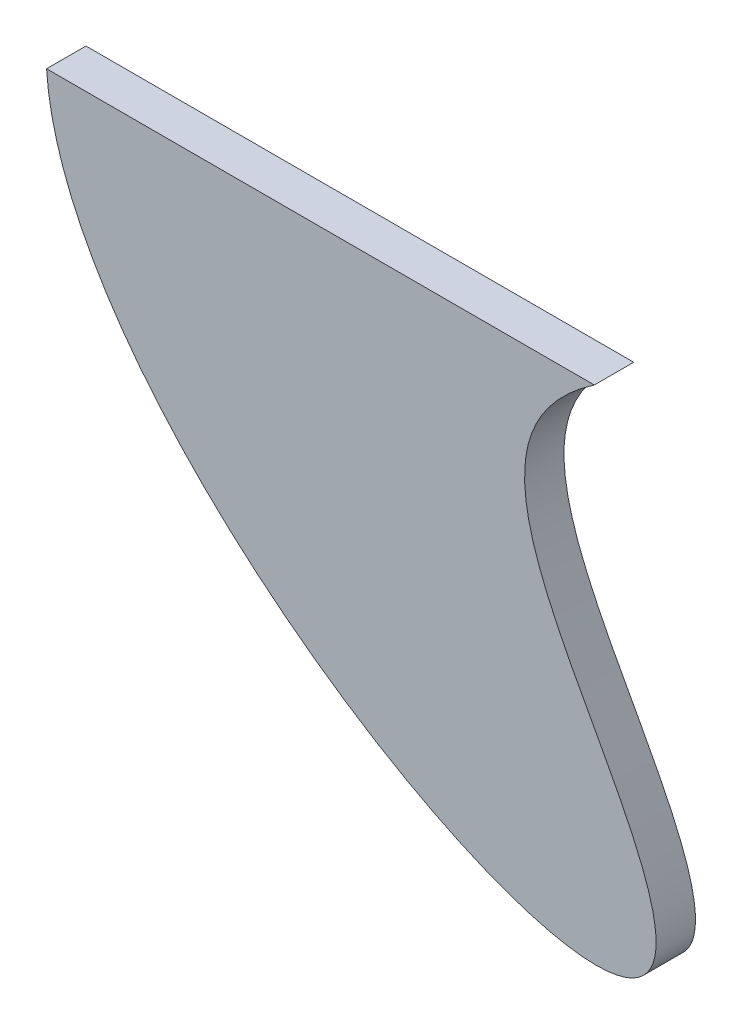
ISO-10303-21;
HEADER;
FILE_DESCRIPTION(('STEP AP214'),'2;1');
FILE_NAME('part.step','',(''),(''),'','','');
FILE_SCHEMA(('AUTOMOTIVE_DESIGN { 1 0 10303 214 1 1 1 1 }'));
ENDSEC;
DATA;
#1=APPLICATION_CONTEXT('core data for automotive mechanical design processes');
#2=APPLICATION_PROTOCOL_DEFINITION('international standard','automotive_design',2000,#1);
#3=PRODUCT_CONTEXT('',#1,'mechanical');
#4=PRODUCT('Part','Part','',(#3));
#5=PRODUCT_RELATED_PRODUCT_CATEGORY('part','',(#4));
#6=PRODUCT_DEFINITION_FORMATION('','',#4);
#7=PRODUCT_DEFINITION_CONTEXT('part definition',#1,'design');
#8=PRODUCT_DEFINITION('design','',#6,#7);
#9=PRODUCT_DEFINITION_SHAPE('','',#8);
#10=(LENGTH_UNIT() NAMED_UNIT(*) SI_UNIT(.MILLI.,.METRE.));
#11=(NAMED_UNIT(*) PLANE_ANGLE_UNIT() SI_UNIT($,.RADIAN.));
#12=(NAMED_UNIT(*) SI_UNIT($,.STERADIAN.) SOLID_ANGLE_UNIT());
#13=UNCERTAINTY_MEASURE_WITH_UNIT(LENGTH_MEASURE(1.E-05),#10,'distance_accuracy_value','');
#14=(GEOMETRIC_REPRESENTATION_CONTEXT(3) GLOBAL_UNCERTAINTY_ASSIGNED_CONTEXT((#13)) GLOBAL_UNIT_ASSIGNED_CONTEXT((#10,
#11,#12)) REPRESENTATION_CONTEXT('',''));
#15=CARTESIAN_POINT('',(0.,0.,0.));
#16=DIRECTION('',(0.,0.,1.));
#17=DIRECTION('',(1.,0.,0.));
#18=AXIS2_PLACEMENT_3D('',#15,#16,#17);
#19=CARTESIAN_POINT('',(0.,0.,4.));
#20=CARTESIAN_POINT('',(1.49528113952527,-23.5165262691292,4.));
#21=CARTESIAN_POINT('',(30.2825322274551,-54.5915059203382,4.));
#22=CARTESIAN_POINT('',(93.815133667424,-78.,4.));
#23=CARTESIAN_POINT('',(76.6176753564072,-40.9292453953554,4.));
#24=CARTESIAN_POINT('',(28.350225173767,-18.8210396506175,4.));
#25=CARTESIAN_POINT('',(55.6328757546256,0.,4.));
#26=B_SPLINE_CURVE_WITH_KNOTS('',6,(#19,#20,#21,#22,#23,#24,#25),.UNSPECIFIED.,.F.,.F.,(7,7),
(0.,1.),.UNSPECIFIED.);
#27=DIRECTION('',(0.,0.,-1.));
#28=VECTOR('',#27,1.);
#29=SURFACE_OF_LINEAR_EXTRUSION('',#26,#28);
#30=CARTESIAN_POINT('',(0.,0.,0.));
#31=CARTESIAN_POINT('',(1.49528113952527,-23.5165262691292,0.));
#32=CARTESIAN_POINT('',(30.2825322274551,-54.5915059203382,0.));
#33=CARTESIAN_POINT('',(93.815133667424,-78.,0.));
#34=CARTESIAN_POINT('',(76.6176753564072,-40.9292453953554,0.));
#35=CARTESIAN_POINT('',(28.350225173767,-18.8210396506175,0.));
#36=CARTESIAN_POINT('',(55.6328757546256,0.,0.));
#37=B_SPLINE_CURVE_WITH_KNOTS('',6,(#30,#31,#32,#33,#34,#35,#36),.UNSPECIFIED.,.F.,.F.,(7,7),
(0.,1.),.UNSPECIFIED.);
#38=CARTESIAN_POINT('',(0.,0.,0.));
#39=VERTEX_POINT('',#38);
#40=CARTESIAN_POINT('',(55.6328757546256,0.,0.));
#41=VERTEX_POINT('',#40);
#42=EDGE_CURVE('E73',#39,#41,#37,.T.);
#43=ORIENTED_EDGE('',*,*,#42,.T.);
#44=DIRECTION('',(0.,0.,-1.));
#45=VECTOR('',#44,1.);
#46=CARTESIAN_POINT('',(55.6328757546256,0.,4.));
#47=LINE('',#46,#45);
#48=CARTESIAN_POINT('',(55.6328757546256,0.,4.));
#49=VERTEX_POINT('',#48);
#50=EDGE_CURVE('E11',#49,#41,#47,.T.);
#51=ORIENTED_EDGE('',*,*,#50,.F.);
#52=CARTESIAN_POINT('',(0.,0.,4.));
#53=VERTEX_POINT('',#52);
#54=EDGE_CURVE('E72',#53,#49,#26,.T.);
#55=ORIENTED_EDGE('',*,*,#54,.F.);
#56=DIRECTION('',(0.,0.,-1.));
#57=VECTOR('',#56,1.);
#58=CARTESIAN_POINT('',(0.,0.,4.));
#59=LINE('',#58,#57);
#60=EDGE_CURVE('E49',#53,#39,#59,.T.);
#61=ORIENTED_EDGE('',*,*,#60,.T.);
#62=EDGE_LOOP('',(#43,#51,#55,#61));
#63=FACE_BOUND('',#62,.T.);
#64=ADVANCED_FACE('F39',(#63),#29,.F.);
#65=CARTESIAN_POINT('',(0.,0.,4.));
#66=DIRECTION('',(0.,-1.,0.));
#67=DIRECTION('',(0.,0.,-1.));
#68=AXIS2_PLACEMENT_3D('',#65,#66,#67);
#69=PLANE('',#68);
#70=DIRECTION('',(-1.,0.,0.));
#71=VECTOR('',#70,1.);
#72=CARTESIAN_POINT('',(0.,0.,0.));
#73=LINE('',#72,#71);
#74=EDGE_CURVE('E64',#41,#39,#73,.T.);
#75=ORIENTED_EDGE('',*,*,#74,.T.);
#76=ORIENTED_EDGE('',*,*,#60,.F.);
#77=DIRECTION('',(-1.,0.,0.));
#78=VECTOR('',#77,1.);
#79=CARTESIAN_POINT('',(0.,0.,4.));
#80=LINE('',#79,#78);
#81=EDGE_CURVE('E56',#49,#53,#80,.T.);
#82=ORIENTED_EDGE('',*,*,#81,.F.);
#83=ORIENTED_EDGE('',*,*,#50,.T.);
#84=EDGE_LOOP('',(#75,#76,#82,#83));
#85=FACE_BOUND('',#84,.T.);
#86=ADVANCED_FACE('F67',(#85),#69,.F.);
#87=CARTESIAN_POINT('',(58.0392453240749,-50.7318228945919,4.));
#88=DIRECTION('',(0.,0.,-1.));
#89=DIRECTION('',(-1.,0.,0.));
#90=AXIS2_PLACEMENT_3D('',#87,#88,#89);
#91=PLANE('',#90);
#92=ORIENTED_EDGE('',*,*,#54,.T.);
#93=ORIENTED_EDGE('',*,*,#81,.T.);
#94=EDGE_LOOP('',(#92,#93));
#95=FACE_BOUND('',#94,.T.);
#96=ADVANCED_FACE('F94',(#95),#91,.F.);
#97=CARTESIAN_POINT('',(58.0392453240749,-50.7318228945919,0.));
#98=DIRECTION('',(0.,0.,-1.));
#99=DIRECTION('',(-1.,0.,0.));
#100=AXIS2_PLACEMENT_3D('',#97,#98,#99);
#101=PLANE('',#100);
#102=ORIENTED_EDGE('',*,*,#42,.F.);
#103=ORIENTED_EDGE('',*,*,#74,.F.);
#104=EDGE_LOOP('',(#102,#103));
#105=FACE_BOUND('',#104,.T.);
#106=ADVANCED_FACE('F77',(#105),#101,.T.);
#107=CLOSED_SHELL('',(#64,#86,#96,#106));
#108=MANIFOLD_SOLID_BREP('B2',#107);
#109=ADVANCED_BREP_SHAPE_REPRESENTATION('',(#18,#108),#14);
#110=SHAPE_DEFINITION_REPRESENTATION(#9,#109);
ENDSEC;
END-ISO-10303-21;
